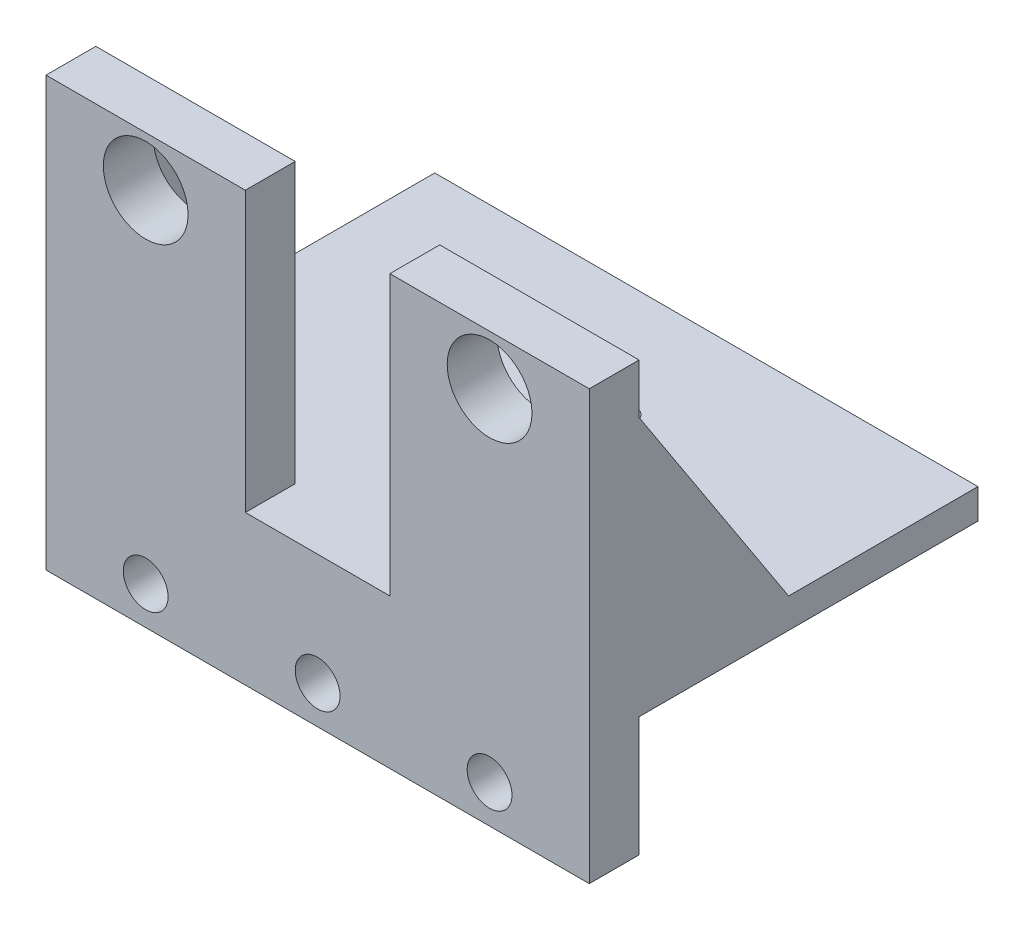
ISO-10303-21;
HEADER;
FILE_DESCRIPTION(('STEP AP214'),'2;1');
FILE_NAME('part.step','',(''),(''),'','','');
FILE_SCHEMA(('AUTOMOTIVE_DESIGN { 1 0 10303 214 1 1 1 1 }'));
ENDSEC;
DATA;
#1=APPLICATION_CONTEXT('core data for automotive mechanical design processes');
#2=APPLICATION_PROTOCOL_DEFINITION('international standard','automotive_design',2000,#1);
#3=PRODUCT_CONTEXT('',#1,'mechanical');
#4=PRODUCT('Part','Part','',(#3));
#5=PRODUCT_RELATED_PRODUCT_CATEGORY('part','',(#4));
#6=PRODUCT_DEFINITION_FORMATION('','',#4);
#7=PRODUCT_DEFINITION_CONTEXT('part definition',#1,'design');
#8=PRODUCT_DEFINITION('design','',#6,#7);
#9=PRODUCT_DEFINITION_SHAPE('','',#8);
#10=(LENGTH_UNIT() NAMED_UNIT(*) SI_UNIT(.MILLI.,.METRE.));
#11=(NAMED_UNIT(*) PLANE_ANGLE_UNIT() SI_UNIT($,.RADIAN.));
#12=(NAMED_UNIT(*) SI_UNIT($,.STERADIAN.) SOLID_ANGLE_UNIT());
#13=UNCERTAINTY_MEASURE_WITH_UNIT(LENGTH_MEASURE(1.E-05),#10,'distance_accuracy_value','');
#14=(GEOMETRIC_REPRESENTATION_CONTEXT(3) GLOBAL_UNCERTAINTY_ASSIGNED_CONTEXT((#13)) GLOBAL_UNIT_ASSIGNED_CONTEXT((#10,
#11,#12)) REPRESENTATION_CONTEXT('',''));
#15=CARTESIAN_POINT('',(0.,0.,0.));
#16=DIRECTION('',(0.,0.,1.));
#17=DIRECTION('',(1.,0.,0.));
#18=AXIS2_PLACEMENT_3D('',#15,#16,#17);
#19=CARTESIAN_POINT('',(0.,3.,0.));
#20=DIRECTION('',(0.,-1.,0.));
#21=DIRECTION('',(0.,0.,-1.));
#22=AXIS2_PLACEMENT_3D('',#19,#20,#21);
#23=PLANE('',#22);
#24=CARTESIAN_POINT('',(-10.1495438408786,3.,-0.129312584143204));
#25=DIRECTION('',(0.,1.,0.));
#26=DIRECTION('',(0.,0.,1.));
#27=AXIS2_PLACEMENT_3D('',#24,#25,#26);
#28=CIRCLE('',#27,1.19999999999999);
#29=CARTESIAN_POINT('',(-10.7694178200066,3.,-1.1568125841432));
#30=VERTEX_POINT('',#29);
#31=CARTESIAN_POINT('',(-9.52966986175057,3.,-1.1568125841432));
#32=VERTEX_POINT('',#31);
#33=EDGE_CURVE('E318',#30,#32,#28,.T.);
#34=ORIENTED_EDGE('',*,*,#33,.F.);
#35=CARTESIAN_POINT('',(-10.1495438408786,3.,-8.1293125841432));
#36=DIRECTION('',(0.,1.,0.));
#37=DIRECTION('',(0.,0.,1.));
#38=AXIS2_PLACEMENT_3D('',#35,#36,#37);
#39=CIRCLE('',#38,7.);
#40=CARTESIAN_POINT('',(-17.121371404645,3.,-7.50192082367236));
#41=VERTEX_POINT('',#40);
#42=EDGE_CURVE('E339',#41,#30,#39,.T.);
#43=ORIENTED_EDGE('',*,*,#42,.F.);
#44=CARTESIAN_POINT('',(-18.1442983711941,3.,-8.12931258414321));
#45=DIRECTION('',(0.,1.,0.));
#46=DIRECTION('',(0.,0.,1.));
#47=AXIS2_PLACEMENT_3D('',#44,#45,#46);
#48=CIRCLE('',#47,1.19999999999999);
#49=CARTESIAN_POINT('',(-17.121371404645,3.,-8.75670434461406));
#50=VERTEX_POINT('',#49);
#51=EDGE_CURVE('E326',#50,#41,#48,.T.);
#52=ORIENTED_EDGE('',*,*,#51,.F.);
#53=CARTESIAN_POINT('',(-10.7694178200066,3.,-15.1018125841432));
#54=VERTEX_POINT('',#53);
#55=EDGE_CURVE('E335',#54,#50,#39,.T.);
#56=ORIENTED_EDGE('',*,*,#55,.F.);
#57=CARTESIAN_POINT('',(-10.1495438408786,3.,-16.1293125841432));
#58=DIRECTION('',(0.,1.,0.));
#59=DIRECTION('',(0.,0.,1.));
#60=AXIS2_PLACEMENT_3D('',#57,#58,#59);
#61=CIRCLE('',#60,1.19999999999999);
#62=CARTESIAN_POINT('',(-9.52966986175058,3.,-15.1018125841432));
#63=VERTEX_POINT('',#62);
#64=EDGE_CURVE('E330',#63,#54,#61,.T.);
#65=ORIENTED_EDGE('',*,*,#64,.F.);
#66=CARTESIAN_POINT('',(-3.17771627711215,3.,-8.75670434461405));
#67=VERTEX_POINT('',#66);
#68=EDGE_CURVE('E334',#67,#63,#39,.T.);
#69=ORIENTED_EDGE('',*,*,#68,.F.);
#70=CARTESIAN_POINT('',(-2.15478931056309,3.,-8.12931258414321));
#71=DIRECTION('',(0.,1.,0.));
#72=DIRECTION('',(0.,0.,1.));
#73=AXIS2_PLACEMENT_3D('',#70,#71,#72);
#74=CIRCLE('',#73,1.19999999999999);
#75=CARTESIAN_POINT('',(-3.17771627711215,3.,-7.50192082367236));
#76=VERTEX_POINT('',#75);
#77=EDGE_CURVE('E322',#76,#67,#74,.T.);
#78=ORIENTED_EDGE('',*,*,#77,.F.);
#79=EDGE_CURVE('E340',#32,#76,#39,.T.);
#80=ORIENTED_EDGE('',*,*,#79,.F.);
#81=EDGE_LOOP('',(#34,#43,#52,#56,#65,#69,#78,#80));
#82=FACE_BOUND('',#81,.T.);
#83=DIRECTION('',(0.,0.,1.));
#84=VECTOR('',#83,1.);
#85=CARTESIAN_POINT('',(-40.6495438408786,3.,11.3706874158568));
#86=LINE('',#85,#84);
#87=CARTESIAN_POINT('',(-40.6495438408786,3.,-27.6293125841432));
#88=VERTEX_POINT('',#87);
#89=CARTESIAN_POINT('',(-40.6495438408786,3.,-8.6293125841432));
#90=VERTEX_POINT('',#89);
#91=EDGE_CURVE('E53',#88,#90,#86,.T.);
#92=ORIENTED_EDGE('',*,*,#91,.T.);
#93=DIRECTION('',(1.,0.,0.));
#94=VECTOR('',#93,1.);
#95=CARTESIAN_POINT('',(0.,3.,-8.6293125841432));
#96=LINE('',#95,#94);
#97=CARTESIAN_POINT('',(-35.6495438408786,3.,-8.6293125841432));
#98=VERTEX_POINT('',#97);
#99=EDGE_CURVE('E48',#90,#98,#96,.T.);
#100=ORIENTED_EDGE('',*,*,#99,.T.);
#101=DIRECTION('',(0.,0.,-1.));
#102=VECTOR('',#101,1.);
#103=CARTESIAN_POINT('',(-35.6495438408786,3.,0.));
#104=LINE('',#103,#102);
#105=CARTESIAN_POINT('',(-35.6495438408786,3.,6.3706874158568));
#106=VERTEX_POINT('',#105);
#107=EDGE_CURVE('E205',#106,#98,#104,.T.);
#108=ORIENTED_EDGE('',*,*,#107,.F.);
#109=DIRECTION('',(-1.,0.,0.));
#110=VECTOR('',#109,1.);
#111=CARTESIAN_POINT('',(-40.6495438408786,3.,6.3706874158568));
#112=LINE('',#111,#110);
#113=CARTESIAN_POINT('',(-20.6495438408786,3.,6.3706874158568));
#114=VERTEX_POINT('',#113);
#115=EDGE_CURVE('E192',#114,#106,#112,.T.);
#116=ORIENTED_EDGE('',*,*,#115,.F.);
#117=DIRECTION('',(0.,0.,-1.));
#118=VECTOR('',#117,1.);
#119=CARTESIAN_POINT('',(-20.6495438408786,3.,11.3706874158568));
#120=LINE('',#119,#118);
#121=CARTESIAN_POINT('',(-20.6495438408786,3.,11.3706874158568));
#122=VERTEX_POINT('',#121);
#123=EDGE_CURVE('E203',#122,#114,#120,.T.);
#124=ORIENTED_EDGE('',*,*,#123,.F.);
#125=DIRECTION('',(1.,0.,0.));
#126=VECTOR('',#125,1.);
#127=CARTESIAN_POINT('',(-40.6495438408786,3.,11.3706874158568));
#128=LINE('',#127,#126);
#129=CARTESIAN_POINT('',(-6.14954384087858,3.,11.3706874158568));
#130=VERTEX_POINT('',#129);
#131=EDGE_CURVE('E342',#122,#130,#128,.T.);
#132=ORIENTED_EDGE('',*,*,#131,.T.);
#133=DIRECTION('',(0.,0.,1.));
#134=VECTOR('',#133,1.);
#135=CARTESIAN_POINT('',(-6.14954384087857,3.,11.3706874158568));
#136=LINE('',#135,#134);
#137=CARTESIAN_POINT('',(-6.14954384087857,3.,6.3706874158568));
#138=VERTEX_POINT('',#137);
#139=EDGE_CURVE('E301',#138,#130,#136,.T.);
#140=ORIENTED_EDGE('',*,*,#139,.F.);
#141=DIRECTION('',(-1.,0.,0.));
#142=VECTOR('',#141,1.);
#143=CARTESIAN_POINT('',(13.8504561591214,3.,6.3706874158568));
#144=LINE('',#143,#142);
#145=CARTESIAN_POINT('',(8.85045615912142,3.,6.3706874158568));
#146=VERTEX_POINT('',#145);
#147=EDGE_CURVE('E297',#146,#138,#144,.T.);
#148=ORIENTED_EDGE('',*,*,#147,.F.);
#149=DIRECTION('',(0.,0.,1.));
#150=VECTOR('',#149,1.);
#151=CARTESIAN_POINT('',(8.85045615912142,3.,0.));
#152=LINE('',#151,#150);
#153=CARTESIAN_POINT('',(8.85045615912142,3.,-8.6293125841432));
#154=VERTEX_POINT('',#153);
#155=EDGE_CURVE('E230',#154,#146,#152,.T.);
#156=ORIENTED_EDGE('',*,*,#155,.F.);
#157=DIRECTION('',(-1.,0.,0.));
#158=VECTOR('',#157,1.);
#159=CARTESIAN_POINT('',(0.,3.,-8.6293125841432));
#160=LINE('',#159,#158);
#161=CARTESIAN_POINT('',(13.8504561591214,3.,-8.6293125841432));
#162=VERTEX_POINT('',#161);
#163=EDGE_CURVE('E235',#154,#162,#160,.F.);
#164=ORIENTED_EDGE('',*,*,#163,.T.);
#165=DIRECTION('',(0.,0.,-1.));
#166=VECTOR('',#165,1.);
#167=CARTESIAN_POINT('',(13.8504561591214,3.,11.3706874158568));
#168=LINE('',#167,#166);
#169=CARTESIAN_POINT('',(13.8504561591214,3.,-27.6293125841432));
#170=VERTEX_POINT('',#169);
#171=EDGE_CURVE('E345',#162,#170,#168,.T.);
#172=ORIENTED_EDGE('',*,*,#171,.T.);
#173=DIRECTION('',(-1.,0.,0.));
#174=VECTOR('',#173,1.);
#175=CARTESIAN_POINT('',(-40.6495438408786,3.,-27.6293125841432));
#176=LINE('',#175,#174);
#177=EDGE_CURVE('E347',#170,#88,#176,.T.);
#178=ORIENTED_EDGE('',*,*,#177,.T.);
#179=EDGE_LOOP('',(#92,#100,#108,#116,#124,#132,#140,#148,#156,#164,#172,#178));
#180=FACE_BOUND('',#179,.T.);
#181=ADVANCED_FACE('F32',(#82,#180),#23,.F.);
#182=CARTESIAN_POINT('',(-10.1495438408786,-2.,-8.1293125841432));
#183=DIRECTION('',(0.,1.,0.));
#184=DIRECTION('',(0.,0.,1.));
#185=AXIS2_PLACEMENT_3D('',#182,#183,#184);
#186=CYLINDRICAL_SURFACE('',#185,7.);
#187=CARTESIAN_POINT('',(-10.1495438408786,0.,-8.1293125841432));
#188=DIRECTION('',(0.,-1.,0.));
#189=DIRECTION('',(0.,0.,-1.));
#190=AXIS2_PLACEMENT_3D('',#187,#188,#189);
#191=CIRCLE('',#190,7.);
#192=CARTESIAN_POINT('',(-3.17771627711215,0.,-7.50192082367236));
#193=VERTEX_POINT('',#192);
#194=CARTESIAN_POINT('',(-9.52966986175059,0.,-1.1568125841432));
#195=VERTEX_POINT('',#194);
#196=EDGE_CURVE('E369',#193,#195,#191,.T.);
#197=ORIENTED_EDGE('',*,*,#196,.T.);
#198=DIRECTION('',(0.,1.,0.));
#199=VECTOR('',#198,1.);
#200=CARTESIAN_POINT('',(-9.52966986175059,-5.5,-1.15681258414321));
#201=LINE('',#200,#199);
#202=EDGE_CURVE('E11',#195,#32,#201,.T.);
#203=ORIENTED_EDGE('',*,*,#202,.T.);
#204=ORIENTED_EDGE('',*,*,#79,.T.);
#205=DIRECTION('',(0.,1.,0.));
#206=VECTOR('',#205,1.);
#207=CARTESIAN_POINT('',(-3.17771627711215,-5.5,-7.50192082367236));
#208=LINE('',#207,#206);
#209=EDGE_CURVE('E382',#76,#193,#208,.F.);
#210=ORIENTED_EDGE('',*,*,#209,.T.);
#211=EDGE_LOOP('',(#197,#203,#204,#210));
#212=FACE_BOUND('',#211,.T.);
#213=ADVANCED_FACE('F435',(#212),#186,.F.);
#214=CARTESIAN_POINT('',(-9.52966986175059,0.,-15.1018125841432));
#215=VERTEX_POINT('',#214);
#216=CARTESIAN_POINT('',(-3.17771627711215,0.,-8.75670434461405));
#217=VERTEX_POINT('',#216);
#218=EDGE_CURVE('E353',#215,#217,#191,.T.);
#219=ORIENTED_EDGE('',*,*,#218,.T.);
#220=DIRECTION('',(0.,1.,0.));
#221=VECTOR('',#220,1.);
#222=CARTESIAN_POINT('',(-3.17771627711215,-5.5,-8.75670434461405));
#223=LINE('',#222,#221);
#224=EDGE_CURVE('E385',#217,#67,#223,.T.);
#225=ORIENTED_EDGE('',*,*,#224,.T.);
#226=ORIENTED_EDGE('',*,*,#68,.T.);
#227=DIRECTION('',(0.,1.,0.));
#228=VECTOR('',#227,1.);
#229=CARTESIAN_POINT('',(-9.52966986175059,-5.5,-15.1018125841432));
#230=LINE('',#229,#228);
#231=EDGE_CURVE('E366',#63,#215,#230,.F.);
#232=ORIENTED_EDGE('',*,*,#231,.T.);
#233=EDGE_LOOP('',(#219,#225,#226,#232));
#234=FACE_BOUND('',#233,.T.);
#235=ADVANCED_FACE('F416',(#234),#186,.F.);
#236=ORIENTED_EDGE('',*,*,#42,.T.);
#237=DIRECTION('',(0.,1.,0.));
#238=VECTOR('',#237,1.);
#239=CARTESIAN_POINT('',(-10.7694178200066,-5.5,-1.15681258414321));
#240=LINE('',#239,#238);
#241=CARTESIAN_POINT('',(-10.7694178200066,0.,-1.1568125841432));
#242=VERTEX_POINT('',#241);
#243=EDGE_CURVE('E41',#30,#242,#240,.F.);
#244=ORIENTED_EDGE('',*,*,#243,.T.);
#245=CARTESIAN_POINT('',(-17.121371404645,0.,-7.50192082367236));
#246=VERTEX_POINT('',#245);
#247=EDGE_CURVE('E370',#242,#246,#191,.T.);
#248=ORIENTED_EDGE('',*,*,#247,.T.);
#249=DIRECTION('',(0.,1.,0.));
#250=VECTOR('',#249,1.);
#251=CARTESIAN_POINT('',(-17.121371404645,-5.5,-7.50192082367236));
#252=LINE('',#251,#250);
#253=EDGE_CURVE('E379',#246,#41,#252,.T.);
#254=ORIENTED_EDGE('',*,*,#253,.T.);
#255=EDGE_LOOP('',(#236,#244,#248,#254));
#256=FACE_BOUND('',#255,.T.);
#257=ADVANCED_FACE('F392',(#256),#186,.F.);
#258=CARTESIAN_POINT('',(-40.6495438408786,3.,11.3706874158568));
#259=DIRECTION('',(1.,0.,0.));
#260=DIRECTION('',(0.,0.,-1.));
#261=AXIS2_PLACEMENT_3D('',#258,#259,#260);
#262=PLANE('',#261);
#263=DIRECTION('',(0.,-1.,0.));
#264=VECTOR('',#263,1.);
#265=CARTESIAN_POINT('',(-40.6495438408786,3.,11.3706874158568));
#266=LINE('',#265,#264);
#267=CARTESIAN_POINT('',(-40.6495438408786,31.,11.3706874158568));
#268=VERTEX_POINT('',#267);
#269=CARTESIAN_POINT('',(-40.6495438408786,-12.,11.3706874158568));
#270=VERTEX_POINT('',#269);
#271=EDGE_CURVE('E363',#268,#270,#266,.T.);
#272=ORIENTED_EDGE('',*,*,#271,.F.);
#273=DIRECTION('',(0.,0.,1.));
#274=VECTOR('',#273,1.);
#275=CARTESIAN_POINT('',(-40.6495438408786,31.,11.3706874158568));
#276=LINE('',#275,#274);
#277=CARTESIAN_POINT('',(-40.6495438408786,31.,6.3706874158568));
#278=VERTEX_POINT('',#277);
#279=EDGE_CURVE('E202',#278,#268,#276,.T.);
#280=ORIENTED_EDGE('',*,*,#279,.F.);
#281=DIRECTION('',(0.,-1.,0.));
#282=VECTOR('',#281,1.);
#283=CARTESIAN_POINT('',(-40.6495438408786,31.,6.3706874158568));
#284=LINE('',#283,#282);
#285=CARTESIAN_POINT('',(-40.6495438408786,26.,6.3706874158568));
#286=VERTEX_POINT('',#285);
#287=EDGE_CURVE('E289',#278,#286,#284,.T.);
#288=ORIENTED_EDGE('',*,*,#287,.T.);
#289=DIRECTION('',(0.,-0.837610596838614,-0.546267780546922));
#290=VECTOR('',#289,1.);
#291=CARTESIAN_POINT('',(-40.6495438408786,26.,6.3706874158568));
#292=LINE('',#291,#290);
#293=EDGE_CURVE('E213',#286,#90,#292,.T.);
#294=ORIENTED_EDGE('',*,*,#293,.T.);
#295=ORIENTED_EDGE('',*,*,#91,.F.);
#296=DIRECTION('',(0.,-1.,0.));
#297=VECTOR('',#296,1.);
#298=CARTESIAN_POINT('',(-40.6495438408786,3.,-27.6293125841432));
#299=LINE('',#298,#297);
#300=CARTESIAN_POINT('',(-40.6495438408786,0.,-27.6293125841432));
#301=VERTEX_POINT('',#300);
#302=EDGE_CURVE('E349',#88,#301,#299,.T.);
#303=ORIENTED_EDGE('',*,*,#302,.T.);
#304=DIRECTION('',(0.,0.,1.));
#305=VECTOR('',#304,1.);
#306=CARTESIAN_POINT('',(-40.6495438408786,0.,11.3706874158568));
#307=LINE('',#306,#305);
#308=CARTESIAN_POINT('',(-40.6495438408786,0.,6.3706874158568));
#309=VERTEX_POINT('',#308);
#310=EDGE_CURVE('E350',#301,#309,#307,.T.);
#311=ORIENTED_EDGE('',*,*,#310,.T.);
#312=DIRECTION('',(0.,1.,0.));
#313=VECTOR('',#312,1.);
#314=CARTESIAN_POINT('',(-40.6495438408786,-12.,6.3706874158568));
#315=LINE('',#314,#313);
#316=CARTESIAN_POINT('',(-40.6495438408786,-12.,6.3706874158568));
#317=VERTEX_POINT('',#316);
#318=EDGE_CURVE('E267',#317,#309,#315,.T.);
#319=ORIENTED_EDGE('',*,*,#318,.F.);
#320=DIRECTION('',(0.,0.,-1.));
#321=VECTOR('',#320,1.);
#322=CARTESIAN_POINT('',(-40.6495438408786,-12.,11.3706874158568));
#323=LINE('',#322,#321);
#324=EDGE_CURVE('E253',#270,#317,#323,.T.);
#325=ORIENTED_EDGE('',*,*,#324,.F.);
#326=EDGE_LOOP('',(#272,#280,#288,#294,#295,#303,#311,#319,#325));
#327=FACE_BOUND('',#326,.T.);
#328=ADVANCED_FACE('F34',(#327),#262,.F.);
#329=CARTESIAN_POINT('',(-40.6495438408786,3.,11.3706874158568));
#330=DIRECTION('',(0.,0.,-1.));
#331=DIRECTION('',(-1.,0.,0.));
#332=AXIS2_PLACEMENT_3D('',#329,#330,#331);
#333=PLANE('',#332);
#334=ORIENTED_EDGE('',*,*,#271,.T.);
#335=DIRECTION('',(-1.,0.,0.));
#336=VECTOR('',#335,1.);
#337=CARTESIAN_POINT('',(-40.6495438408786,-12.,11.3706874158568));
#338=LINE('',#337,#336);
#339=CARTESIAN_POINT('',(13.8504561591214,-12.,11.3706874158568));
#340=VERTEX_POINT('',#339);
#341=EDGE_CURVE('E261',#340,#270,#338,.T.);
#342=ORIENTED_EDGE('',*,*,#341,.F.);
#343=DIRECTION('',(0.,-1.,0.));
#344=VECTOR('',#343,1.);
#345=CARTESIAN_POINT('',(13.8504561591214,3.,11.3706874158568));
#346=LINE('',#345,#344);
#347=CARTESIAN_POINT('',(13.8504561591214,31.,11.3706874158568));
#348=VERTEX_POINT('',#347);
#349=EDGE_CURVE('E361',#348,#340,#346,.T.);
#350=ORIENTED_EDGE('',*,*,#349,.F.);
#351=DIRECTION('',(1.,0.,0.));
#352=VECTOR('',#351,1.);
#353=CARTESIAN_POINT('',(13.8504561591214,31.,11.3706874158568));
#354=LINE('',#353,#352);
#355=CARTESIAN_POINT('',(-6.14954384087857,31.,11.3706874158568));
#356=VERTEX_POINT('',#355);
#357=EDGE_CURVE('E305',#356,#348,#354,.T.);
#358=ORIENTED_EDGE('',*,*,#357,.F.);
#359=DIRECTION('',(0.,-1.,0.));
#360=VECTOR('',#359,1.);
#361=CARTESIAN_POINT('',(-6.14954384087857,31.,11.3706874158568));
#362=LINE('',#361,#360);
#363=EDGE_CURVE('E307',#356,#130,#362,.T.);
#364=ORIENTED_EDGE('',*,*,#363,.T.);
#365=ORIENTED_EDGE('',*,*,#131,.F.);
#366=DIRECTION('',(0.,-1.,0.));
#367=VECTOR('',#366,1.);
#368=CARTESIAN_POINT('',(-20.6495438408786,31.,11.3706874158568));
#369=LINE('',#368,#367);
#370=CARTESIAN_POINT('',(-20.6495438408786,31.,11.3706874158568));
#371=VERTEX_POINT('',#370);
#372=EDGE_CURVE('E294',#371,#122,#369,.T.);
#373=ORIENTED_EDGE('',*,*,#372,.F.);
#374=DIRECTION('',(1.,0.,0.));
#375=VECTOR('',#374,1.);
#376=CARTESIAN_POINT('',(-40.6495438408786,31.,11.3706874158568));
#377=LINE('',#376,#375);
#378=EDGE_CURVE('E283',#268,#371,#377,.T.);
#379=ORIENTED_EDGE('',*,*,#378,.F.);
#380=EDGE_LOOP('',(#334,#342,#350,#358,#364,#365,#373,#379));
#381=FACE_BOUND('',#380,.T.);
#382=CARTESIAN_POINT('',(-30.6495438408786,-8.2,11.3706874158568));
#383=DIRECTION('',(0.,0.,1.));
#384=DIRECTION('',(1.,0.,0.));
#385=AXIS2_PLACEMENT_3D('',#382,#383,#384);
#386=CIRCLE('',#385,2.24789999999999);
#387=CARTESIAN_POINT('',(-28.4016438408786,-8.2,11.3706874158568));
#388=VERTEX_POINT('',#387);
#389=EDGE_CURVE('E237',#388,#388,#386,.T.);
#390=ORIENTED_EDGE('',*,*,#389,.F.);
#391=EDGE_LOOP('',(#390));
#392=FACE_BOUND('',#391,.T.);
#393=CARTESIAN_POINT('',(-13.3995438408786,-8.2,11.3706874158568));
#394=DIRECTION('',(0.,0.,1.));
#395=DIRECTION('',(1.,0.,0.));
#396=AXIS2_PLACEMENT_3D('',#393,#394,#395);
#397=CIRCLE('',#396,2.24789999999999);
#398=CARTESIAN_POINT('',(-11.1516438408786,-8.2,11.3706874158568));
#399=VERTEX_POINT('',#398);
#400=EDGE_CURVE('E240',#399,#399,#397,.T.);
#401=ORIENTED_EDGE('',*,*,#400,.F.);
#402=EDGE_LOOP('',(#401));
#403=FACE_BOUND('',#402,.T.);
#404=CARTESIAN_POINT('',(3.85045615912143,-8.2,11.3706874158568));
#405=DIRECTION('',(0.,0.,1.));
#406=DIRECTION('',(1.,0.,0.));
#407=AXIS2_PLACEMENT_3D('',#404,#405,#406);
#408=CIRCLE('',#407,2.24789999999999);
#409=CARTESIAN_POINT('',(6.09835615912141,-8.2,11.3706874158568));
#410=VERTEX_POINT('',#409);
#411=EDGE_CURVE('E246',#410,#410,#408,.T.);
#412=ORIENTED_EDGE('',*,*,#411,.F.);
#413=EDGE_LOOP('',(#412));
#414=FACE_BOUND('',#413,.T.);
#415=CARTESIAN_POINT('',(3.85045615912143,26.,11.3706874158568));
#416=DIRECTION('',(0.,0.,-1.));
#417=DIRECTION('',(-1.,0.,0.));
#418=AXIS2_PLACEMENT_3D('',#415,#416,#417);
#419=CIRCLE('',#418,4.25);
#420=CARTESIAN_POINT('',(-0.399543840878573,26.,11.3706874158568));
#421=VERTEX_POINT('',#420);
#422=EDGE_CURVE('E271',#421,#421,#419,.T.);
#423=ORIENTED_EDGE('',*,*,#422,.T.);
#424=EDGE_LOOP('',(#423));
#425=FACE_BOUND('',#424,.T.);
#426=CARTESIAN_POINT('',(-30.6495438408786,26.,11.3706874158568));
#427=DIRECTION('',(0.,0.,-1.));
#428=DIRECTION('',(-1.,0.,0.));
#429=AXIS2_PLACEMENT_3D('',#426,#427,#428);
#430=CIRCLE('',#429,4.25);
#431=CARTESIAN_POINT('',(-34.8995438408786,26.,11.3706874158568));
#432=VERTEX_POINT('',#431);
#433=EDGE_CURVE('E277',#432,#432,#430,.T.);
#434=ORIENTED_EDGE('',*,*,#433,.T.);
#435=EDGE_LOOP('',(#434));
#436=FACE_BOUND('',#435,.T.);
#437=ADVANCED_FACE('F452',(#381,#392,#403,#414,#425,#436),#333,.F.);
#438=CARTESIAN_POINT('',(13.8504561591214,3.,11.3706874158568));
#439=DIRECTION('',(-1.,0.,0.));
#440=DIRECTION('',(0.,0.,1.));
#441=AXIS2_PLACEMENT_3D('',#438,#439,#440);
#442=PLANE('',#441);
#443=ORIENTED_EDGE('',*,*,#171,.F.);
#444=DIRECTION('',(0.,-0.837610596838614,-0.546267780546922));
#445=VECTOR('',#444,1.);
#446=CARTESIAN_POINT('',(13.8504561591214,26.,6.3706874158568));
#447=LINE('',#446,#445);
#448=CARTESIAN_POINT('',(13.8504561591214,26.,6.3706874158568));
#449=VERTEX_POINT('',#448);
#450=EDGE_CURVE('E222',#449,#162,#447,.T.);
#451=ORIENTED_EDGE('',*,*,#450,.F.);
#452=DIRECTION('',(0.,-1.,0.));
#453=VECTOR('',#452,1.);
#454=CARTESIAN_POINT('',(13.8504561591214,31.,6.3706874158568));
#455=LINE('',#454,#453);
#456=CARTESIAN_POINT('',(13.8504561591214,31.,6.3706874158568));
#457=VERTEX_POINT('',#456);
#458=EDGE_CURVE('E316',#457,#449,#455,.T.);
#459=ORIENTED_EDGE('',*,*,#458,.F.);
#460=DIRECTION('',(0.,0.,-1.));
#461=VECTOR('',#460,1.);
#462=CARTESIAN_POINT('',(13.8504561591214,31.,11.3706874158568));
#463=LINE('',#462,#461);
#464=EDGE_CURVE('E298',#348,#457,#463,.T.);
#465=ORIENTED_EDGE('',*,*,#464,.F.);
#466=ORIENTED_EDGE('',*,*,#349,.T.);
#467=DIRECTION('',(0.,0.,1.));
#468=VECTOR('',#467,1.);
#469=CARTESIAN_POINT('',(13.8504561591214,-12.,11.3706874158568));
#470=LINE('',#469,#468);
#471=CARTESIAN_POINT('',(13.8504561591214,-12.,6.3706874158568));
#472=VERTEX_POINT('',#471);
#473=EDGE_CURVE('E258',#472,#340,#470,.T.);
#474=ORIENTED_EDGE('',*,*,#473,.F.);
#475=DIRECTION('',(0.,1.,0.));
#476=VECTOR('',#475,1.);
#477=CARTESIAN_POINT('',(13.8504561591214,-12.,6.3706874158568));
#478=LINE('',#477,#476);
#479=CARTESIAN_POINT('',(13.8504561591214,0.,6.3706874158568));
#480=VERTEX_POINT('',#479);
#481=EDGE_CURVE('E263',#472,#480,#478,.T.);
#482=ORIENTED_EDGE('',*,*,#481,.T.);
#483=DIRECTION('',(0.,0.,-1.));
#484=VECTOR('',#483,1.);
#485=CARTESIAN_POINT('',(13.8504561591214,0.,11.3706874158568));
#486=LINE('',#485,#484);
#487=CARTESIAN_POINT('',(13.8504561591214,0.,-27.6293125841432));
#488=VERTEX_POINT('',#487);
#489=EDGE_CURVE('E352',#480,#488,#486,.T.);
#490=ORIENTED_EDGE('',*,*,#489,.T.);
#491=DIRECTION('',(0.,-1.,0.));
#492=VECTOR('',#491,1.);
#493=CARTESIAN_POINT('',(13.8504561591214,3.,-27.6293125841432));
#494=LINE('',#493,#492);
#495=EDGE_CURVE('E358',#170,#488,#494,.T.);
#496=ORIENTED_EDGE('',*,*,#495,.F.);
#497=EDGE_LOOP('',(#443,#451,#459,#465,#466,#474,#482,#490,#496));
#498=FACE_BOUND('',#497,.T.);
#499=ADVANCED_FACE('F449',(#498),#442,.F.);
#500=CARTESIAN_POINT('',(-40.6495438408786,3.,-27.6293125841432));
#501=DIRECTION('',(0.,0.,1.));
#502=DIRECTION('',(1.,0.,0.));
#503=AXIS2_PLACEMENT_3D('',#500,#501,#502);
#504=PLANE('',#503);
#505=DIRECTION('',(-1.,0.,0.));
#506=VECTOR('',#505,1.);
#507=CARTESIAN_POINT('',(-40.6495438408786,0.,-27.6293125841432));
#508=LINE('',#507,#506);
#509=EDGE_CURVE('E343',#488,#301,#508,.T.);
#510=ORIENTED_EDGE('',*,*,#509,.T.);
#511=ORIENTED_EDGE('',*,*,#302,.F.);
#512=ORIENTED_EDGE('',*,*,#177,.F.);
#513=ORIENTED_EDGE('',*,*,#495,.T.);
#514=EDGE_LOOP('',(#510,#511,#512,#513));
#515=FACE_BOUND('',#514,.T.);
#516=ADVANCED_FACE('F445',(#515),#504,.F.);
#517=CARTESIAN_POINT('',(0.,0.,0.));
#518=DIRECTION('',(0.,-1.,0.));
#519=DIRECTION('',(0.,0.,-1.));
#520=AXIS2_PLACEMENT_3D('',#517,#518,#519);
#521=PLANE('',#520);
#522=DIRECTION('',(1.,0.,0.));
#523=VECTOR('',#522,1.);
#524=CARTESIAN_POINT('',(-40.6495438408786,0.,6.3706874158568));
#525=LINE('',#524,#523);
#526=EDGE_CURVE('E252',#309,#480,#525,.T.);
#527=ORIENTED_EDGE('',*,*,#526,.F.);
#528=ORIENTED_EDGE('',*,*,#310,.F.);
#529=ORIENTED_EDGE('',*,*,#509,.F.);
#530=ORIENTED_EDGE('',*,*,#489,.F.);
#531=EDGE_LOOP('',(#527,#528,#529,#530));
#532=FACE_BOUND('',#531,.T.);
#533=CARTESIAN_POINT('',(-10.1495438408786,0.,-0.129312584143204));
#534=DIRECTION('',(0.,-1.,0.));
#535=DIRECTION('',(0.,0.,-1.));
#536=AXIS2_PLACEMENT_3D('',#533,#534,#535);
#537=CIRCLE('',#536,1.19999999999999);
#538=EDGE_CURVE('E320',#195,#242,#537,.T.);
#539=ORIENTED_EDGE('',*,*,#538,.F.);
#540=ORIENTED_EDGE('',*,*,#196,.F.);
#541=CARTESIAN_POINT('',(-2.15478931056309,0.,-8.12931258414321));
#542=DIRECTION('',(0.,-1.,0.));
#543=DIRECTION('',(0.,0.,-1.));
#544=AXIS2_PLACEMENT_3D('',#541,#542,#543);
#545=CIRCLE('',#544,1.19999999999999);
#546=EDGE_CURVE('E324',#217,#193,#545,.T.);
#547=ORIENTED_EDGE('',*,*,#546,.F.);
#548=ORIENTED_EDGE('',*,*,#218,.F.);
#549=CARTESIAN_POINT('',(-10.1495438408786,0.,-16.1293125841432));
#550=DIRECTION('',(0.,-1.,0.));
#551=DIRECTION('',(0.,0.,-1.));
#552=AXIS2_PLACEMENT_3D('',#549,#550,#551);
#553=CIRCLE('',#552,1.19999999999999);
#554=CARTESIAN_POINT('',(-10.7694178200066,0.,-15.1018125841432));
#555=VERTEX_POINT('',#554);
#556=EDGE_CURVE('E332',#555,#215,#553,.T.);
#557=ORIENTED_EDGE('',*,*,#556,.F.);
#558=CARTESIAN_POINT('',(-17.121371404645,0.,-8.75670434461406));
#559=VERTEX_POINT('',#558);
#560=EDGE_CURVE('E338',#559,#555,#191,.T.);
#561=ORIENTED_EDGE('',*,*,#560,.F.);
#562=CARTESIAN_POINT('',(-18.1442983711941,0.,-8.12931258414321));
#563=DIRECTION('',(0.,-1.,0.));
#564=DIRECTION('',(0.,0.,-1.));
#565=AXIS2_PLACEMENT_3D('',#562,#563,#564);
#566=CIRCLE('',#565,1.19999999999999);
#567=EDGE_CURVE('E328',#246,#559,#566,.T.);
#568=ORIENTED_EDGE('',*,*,#567,.F.);
#569=ORIENTED_EDGE('',*,*,#247,.F.);
#570=EDGE_LOOP('',(#539,#540,#547,#548,#557,#561,#568,#569));
#571=FACE_BOUND('',#570,.T.);
#572=ADVANCED_FACE('F400',(#532,#571),#521,.T.);
#573=ORIENTED_EDGE('',*,*,#55,.T.);
#574=DIRECTION('',(0.,1.,0.));
#575=VECTOR('',#574,1.);
#576=CARTESIAN_POINT('',(-17.121371404645,-5.5,-8.75670434461405));
#577=LINE('',#576,#575);
#578=EDGE_CURVE('E376',#50,#559,#577,.F.);
#579=ORIENTED_EDGE('',*,*,#578,.T.);
#580=ORIENTED_EDGE('',*,*,#560,.T.);
#581=DIRECTION('',(0.,1.,0.));
#582=VECTOR('',#581,1.);
#583=CARTESIAN_POINT('',(-10.7694178200066,-5.5,-15.1018125841432));
#584=LINE('',#583,#582);
#585=EDGE_CURVE('E373',#555,#54,#584,.T.);
#586=ORIENTED_EDGE('',*,*,#585,.T.);
#587=EDGE_LOOP('',(#573,#579,#580,#586));
#588=FACE_BOUND('',#587,.T.);
#589=ADVANCED_FACE('F406',(#588),#186,.F.);
#590=CARTESIAN_POINT('',(-10.1495438408786,3.,-16.1293125841432));
#591=DIRECTION('',(0.,1.,0.));
#592=DIRECTION('',(0.,0.,1.));
#593=AXIS2_PLACEMENT_3D('',#590,#591,#592);
#594=CYLINDRICAL_SURFACE('',#593,1.19999999999999);
#595=ORIENTED_EDGE('',*,*,#556,.T.);
#596=ORIENTED_EDGE('',*,*,#231,.F.);
#597=ORIENTED_EDGE('',*,*,#64,.T.);
#598=ORIENTED_EDGE('',*,*,#585,.F.);
#599=EDGE_LOOP('',(#595,#596,#597,#598));
#600=FACE_BOUND('',#599,.T.);
#601=ADVANCED_FACE('F410',(#600),#594,.F.);
#602=CARTESIAN_POINT('',(-18.1442983711941,3.,-8.12931258414321));
#603=DIRECTION('',(0.,1.,0.));
#604=DIRECTION('',(0.,0.,1.));
#605=AXIS2_PLACEMENT_3D('',#602,#603,#604);
#606=CYLINDRICAL_SURFACE('',#605,1.19999999999999);
#607=ORIENTED_EDGE('',*,*,#567,.T.);
#608=ORIENTED_EDGE('',*,*,#578,.F.);
#609=ORIENTED_EDGE('',*,*,#51,.T.);
#610=ORIENTED_EDGE('',*,*,#253,.F.);
#611=EDGE_LOOP('',(#607,#608,#609,#610));
#612=FACE_BOUND('',#611,.T.);
#613=ADVANCED_FACE('F422',(#612),#606,.F.);
#614=CARTESIAN_POINT('',(-2.15478931056309,3.,-8.12931258414321));
#615=DIRECTION('',(0.,1.,0.));
#616=DIRECTION('',(0.,0.,1.));
#617=AXIS2_PLACEMENT_3D('',#614,#615,#616);
#618=CYLINDRICAL_SURFACE('',#617,1.19999999999999);
#619=ORIENTED_EDGE('',*,*,#546,.T.);
#620=ORIENTED_EDGE('',*,*,#209,.F.);
#621=ORIENTED_EDGE('',*,*,#77,.T.);
#622=ORIENTED_EDGE('',*,*,#224,.F.);
#623=EDGE_LOOP('',(#619,#620,#621,#622));
#624=FACE_BOUND('',#623,.T.);
#625=ADVANCED_FACE('F424',(#624),#618,.F.);
#626=CARTESIAN_POINT('',(-10.1495438408786,3.,-0.129312584143204));
#627=DIRECTION('',(0.,1.,0.));
#628=DIRECTION('',(0.,0.,1.));
#629=AXIS2_PLACEMENT_3D('',#626,#627,#628);
#630=CYLINDRICAL_SURFACE('',#629,1.19999999999999);
#631=ORIENTED_EDGE('',*,*,#538,.T.);
#632=ORIENTED_EDGE('',*,*,#243,.F.);
#633=ORIENTED_EDGE('',*,*,#33,.T.);
#634=ORIENTED_EDGE('',*,*,#202,.F.);
#635=EDGE_LOOP('',(#631,#632,#633,#634));
#636=FACE_BOUND('',#635,.T.);
#637=ADVANCED_FACE('F430',(#636),#630,.F.);
#638=CARTESIAN_POINT('',(13.8504561591214,31.,6.3706874158568));
#639=DIRECTION('',(0.,0.,1.));
#640=DIRECTION('',(1.,0.,0.));
#641=AXIS2_PLACEMENT_3D('',#638,#639,#640);
#642=PLANE('',#641);
#643=CARTESIAN_POINT('',(3.85045615912143,26.,6.3706874158568));
#644=DIRECTION('',(0.,0.,-1.));
#645=DIRECTION('',(-1.,0.,0.));
#646=AXIS2_PLACEMENT_3D('',#643,#644,#645);
#647=CIRCLE('',#646,4.25);
#648=CARTESIAN_POINT('',(-0.399543840878575,26.,6.3706874158568));
#649=VERTEX_POINT('',#648);
#650=EDGE_CURVE('E274',#649,#649,#647,.T.);
#651=ORIENTED_EDGE('',*,*,#650,.F.);
#652=EDGE_LOOP('',(#651));
#653=FACE_BOUND('',#652,.T.);
#654=ORIENTED_EDGE('',*,*,#458,.T.);
#655=DIRECTION('',(1.,0.,0.));
#656=VECTOR('',#655,1.);
#657=CARTESIAN_POINT('',(13.8504561591214,26.,6.3706874158568));
#658=LINE('',#657,#656);
#659=CARTESIAN_POINT('',(8.85045615912142,26.,6.3706874158568));
#660=VERTEX_POINT('',#659);
#661=EDGE_CURVE('E233',#449,#660,#658,.F.);
#662=ORIENTED_EDGE('',*,*,#661,.T.);
#663=DIRECTION('',(0.,1.,0.));
#664=VECTOR('',#663,1.);
#665=CARTESIAN_POINT('',(8.85045615912142,31.,6.3706874158568));
#666=LINE('',#665,#664);
#667=EDGE_CURVE('E225',#146,#660,#666,.T.);
#668=ORIENTED_EDGE('',*,*,#667,.F.);
#669=ORIENTED_EDGE('',*,*,#147,.T.);
#670=DIRECTION('',(0.,-1.,0.));
#671=VECTOR('',#670,1.);
#672=CARTESIAN_POINT('',(-6.14954384087857,31.,6.3706874158568));
#673=LINE('',#672,#671);
#674=CARTESIAN_POINT('',(-6.14954384087857,31.,6.3706874158568));
#675=VERTEX_POINT('',#674);
#676=EDGE_CURVE('E313',#675,#138,#673,.T.);
#677=ORIENTED_EDGE('',*,*,#676,.F.);
#678=DIRECTION('',(-1.,0.,0.));
#679=VECTOR('',#678,1.);
#680=CARTESIAN_POINT('',(13.8504561591214,31.,6.3706874158568));
#681=LINE('',#680,#679);
#682=EDGE_CURVE('E300',#457,#675,#681,.T.);
#683=ORIENTED_EDGE('',*,*,#682,.F.);
#684=EDGE_LOOP('',(#654,#662,#668,#669,#677,#683));
#685=FACE_BOUND('',#684,.T.);
#686=ADVANCED_FACE('F502',(#653,#685),#642,.F.);
#687=CARTESIAN_POINT('',(-6.14954384087857,31.,11.3706874158568));
#688=DIRECTION('',(1.,0.,0.));
#689=DIRECTION('',(0.,0.,-1.));
#690=AXIS2_PLACEMENT_3D('',#687,#688,#689);
#691=PLANE('',#690);
#692=ORIENTED_EDGE('',*,*,#139,.T.);
#693=ORIENTED_EDGE('',*,*,#363,.F.);
#694=DIRECTION('',(0.,0.,1.));
#695=VECTOR('',#694,1.);
#696=CARTESIAN_POINT('',(-6.14954384087857,31.,11.3706874158568));
#697=LINE('',#696,#695);
#698=EDGE_CURVE('E303',#675,#356,#697,.T.);
#699=ORIENTED_EDGE('',*,*,#698,.F.);
#700=ORIENTED_EDGE('',*,*,#676,.T.);
#701=EDGE_LOOP('',(#692,#693,#699,#700));
#702=FACE_BOUND('',#701,.T.);
#703=ADVANCED_FACE('F498',(#702),#691,.F.);
#704=CARTESIAN_POINT('',(0.,31.,0.));
#705=DIRECTION('',(0.,1.,0.));
#706=DIRECTION('',(0.,0.,1.));
#707=AXIS2_PLACEMENT_3D('',#704,#705,#706);
#708=PLANE('',#707);
#709=ORIENTED_EDGE('',*,*,#464,.T.);
#710=ORIENTED_EDGE('',*,*,#682,.T.);
#711=ORIENTED_EDGE('',*,*,#698,.T.);
#712=ORIENTED_EDGE('',*,*,#357,.T.);
#713=EDGE_LOOP('',(#709,#710,#711,#712));
#714=FACE_BOUND('',#713,.T.);
#715=ADVANCED_FACE('F492',(#714),#708,.T.);
#716=CARTESIAN_POINT('',(-20.6495438408786,31.,11.3706874158568));
#717=DIRECTION('',(-1.,0.,0.));
#718=DIRECTION('',(0.,0.,1.));
#719=AXIS2_PLACEMENT_3D('',#716,#717,#718);
#720=PLANE('',#719);
#721=ORIENTED_EDGE('',*,*,#123,.T.);
#722=DIRECTION('',(0.,-1.,0.));
#723=VECTOR('',#722,1.);
#724=CARTESIAN_POINT('',(-20.6495438408786,31.,6.3706874158568));
#725=LINE('',#724,#723);
#726=CARTESIAN_POINT('',(-20.6495438408786,31.,6.3706874158568));
#727=VERTEX_POINT('',#726);
#728=EDGE_CURVE('E199',#727,#114,#725,.T.);
#729=ORIENTED_EDGE('',*,*,#728,.F.);
#730=DIRECTION('',(0.,0.,-1.));
#731=VECTOR('',#730,1.);
#732=CARTESIAN_POINT('',(-20.6495438408786,31.,11.3706874158568));
#733=LINE('',#732,#731);
#734=EDGE_CURVE('E285',#371,#727,#733,.T.);
#735=ORIENTED_EDGE('',*,*,#734,.F.);
#736=ORIENTED_EDGE('',*,*,#372,.T.);
#737=EDGE_LOOP('',(#721,#729,#735,#736));
#738=FACE_BOUND('',#737,.T.);
#739=ADVANCED_FACE('F484',(#738),#720,.F.);
#740=CARTESIAN_POINT('',(-40.6495438408786,31.,6.3706874158568));
#741=DIRECTION('',(0.,0.,1.));
#742=DIRECTION('',(1.,0.,0.));
#743=AXIS2_PLACEMENT_3D('',#740,#741,#742);
#744=PLANE('',#743);
#745=CARTESIAN_POINT('',(-30.6495438408786,26.,6.37068741585681));
#746=DIRECTION('',(0.,0.,-1.));
#747=DIRECTION('',(-1.,0.,0.));
#748=AXIS2_PLACEMENT_3D('',#745,#746,#747);
#749=CIRCLE('',#748,4.25);
#750=CARTESIAN_POINT('',(-34.8995438408786,26.,6.37068741585681));
#751=VERTEX_POINT('',#750);
#752=EDGE_CURVE('E270',#751,#751,#749,.T.);
#753=ORIENTED_EDGE('',*,*,#752,.F.);
#754=EDGE_LOOP('',(#753));
#755=FACE_BOUND('',#754,.T.);
#756=DIRECTION('',(0.,-1.,0.));
#757=VECTOR('',#756,1.);
#758=CARTESIAN_POINT('',(-35.6495438408786,31.,6.3706874158568));
#759=LINE('',#758,#757);
#760=CARTESIAN_POINT('',(-35.6495438408786,26.,6.3706874158568));
#761=VERTEX_POINT('',#760);
#762=EDGE_CURVE('E195',#761,#106,#759,.T.);
#763=ORIENTED_EDGE('',*,*,#762,.F.);
#764=DIRECTION('',(-1.,0.,0.));
#765=VECTOR('',#764,1.);
#766=CARTESIAN_POINT('',(-40.6495438408786,26.,6.3706874158568));
#767=LINE('',#766,#765);
#768=EDGE_CURVE('E209',#761,#286,#767,.T.);
#769=ORIENTED_EDGE('',*,*,#768,.T.);
#770=ORIENTED_EDGE('',*,*,#287,.F.);
#771=DIRECTION('',(-1.,0.,0.));
#772=VECTOR('',#771,1.);
#773=CARTESIAN_POINT('',(-40.6495438408786,31.,6.3706874158568));
#774=LINE('',#773,#772);
#775=EDGE_CURVE('E287',#727,#278,#774,.T.);
#776=ORIENTED_EDGE('',*,*,#775,.F.);
#777=ORIENTED_EDGE('',*,*,#728,.T.);
#778=ORIENTED_EDGE('',*,*,#115,.T.);
#779=EDGE_LOOP('',(#763,#769,#770,#776,#777,#778));
#780=FACE_BOUND('',#779,.T.);
#781=ADVANCED_FACE('F193',(#755,#780),#744,.F.);
#782=CARTESIAN_POINT('',(0.,31.,0.));
#783=DIRECTION('',(0.,-1.,0.));
#784=DIRECTION('',(0.,0.,-1.));
#785=AXIS2_PLACEMENT_3D('',#782,#783,#784);
#786=PLANE('',#785);
#787=ORIENTED_EDGE('',*,*,#279,.T.);
#788=ORIENTED_EDGE('',*,*,#378,.T.);
#789=ORIENTED_EDGE('',*,*,#734,.T.);
#790=ORIENTED_EDGE('',*,*,#775,.T.);
#791=EDGE_LOOP('',(#787,#788,#789,#790));
#792=FACE_BOUND('',#791,.T.);
#793=ADVANCED_FACE('F479',(#792),#786,.F.);
#794=CARTESIAN_POINT('',(-30.6495438408786,26.,11.3706874158568));
#795=DIRECTION('',(0.,0.,-1.));
#796=DIRECTION('',(-1.,0.,0.));
#797=AXIS2_PLACEMENT_3D('',#794,#795,#796);
#798=CYLINDRICAL_SURFACE('',#797,4.25);
#799=ORIENTED_EDGE('',*,*,#433,.F.);
#800=EDGE_LOOP('',(#799));
#801=FACE_BOUND('',#800,.T.);
#802=ORIENTED_EDGE('',*,*,#752,.T.);
#803=EDGE_LOOP('',(#802));
#804=FACE_BOUND('',#803,.T.);
#805=ADVANCED_FACE('F475',(#801,#804),#798,.F.);
#806=CARTESIAN_POINT('',(3.85045615912143,26.,11.3706874158568));
#807=DIRECTION('',(0.,0.,-1.));
#808=DIRECTION('',(-1.,0.,0.));
#809=AXIS2_PLACEMENT_3D('',#806,#807,#808);
#810=CYLINDRICAL_SURFACE('',#809,4.25);
#811=ORIENTED_EDGE('',*,*,#422,.F.);
#812=EDGE_LOOP('',(#811));
#813=FACE_BOUND('',#812,.T.);
#814=ORIENTED_EDGE('',*,*,#650,.T.);
#815=EDGE_LOOP('',(#814));
#816=FACE_BOUND('',#815,.T.);
#817=ADVANCED_FACE('F478',(#813,#816),#810,.F.);
#818=CARTESIAN_POINT('',(-40.6495438408786,-12.,6.3706874158568));
#819=DIRECTION('',(0.,0.,1.));
#820=DIRECTION('',(1.,0.,0.));
#821=AXIS2_PLACEMENT_3D('',#818,#819,#820);
#822=PLANE('',#821);
#823=ORIENTED_EDGE('',*,*,#526,.T.);
#824=ORIENTED_EDGE('',*,*,#481,.F.);
#825=DIRECTION('',(1.,0.,0.));
#826=VECTOR('',#825,1.);
#827=CARTESIAN_POINT('',(-40.6495438408786,-12.,6.3706874158568));
#828=LINE('',#827,#826);
#829=EDGE_CURVE('E256',#317,#472,#828,.T.);
#830=ORIENTED_EDGE('',*,*,#829,.F.);
#831=ORIENTED_EDGE('',*,*,#318,.T.);
#832=EDGE_LOOP('',(#823,#824,#830,#831));
#833=FACE_BOUND('',#832,.T.);
#834=CARTESIAN_POINT('',(-30.6495438408786,-8.2,6.3706874158568));
#835=DIRECTION('',(0.,0.,1.));
#836=DIRECTION('',(1.,0.,0.));
#837=AXIS2_PLACEMENT_3D('',#834,#835,#836);
#838=CIRCLE('',#837,2.24789999999999);
#839=CARTESIAN_POINT('',(-28.4016438408786,-8.2,6.3706874158568));
#840=VERTEX_POINT('',#839);
#841=EDGE_CURVE('E36',#840,#840,#838,.T.);
#842=ORIENTED_EDGE('',*,*,#841,.T.);
#843=EDGE_LOOP('',(#842));
#844=FACE_BOUND('',#843,.T.);
#845=CARTESIAN_POINT('',(-13.3995438408786,-8.2,6.3706874158568));
#846=DIRECTION('',(0.,0.,1.));
#847=DIRECTION('',(1.,0.,0.));
#848=AXIS2_PLACEMENT_3D('',#845,#846,#847);
#849=CIRCLE('',#848,2.24789999999999);
#850=CARTESIAN_POINT('',(-11.1516438408786,-8.2,6.3706874158568));
#851=VERTEX_POINT('',#850);
#852=EDGE_CURVE('E243',#851,#851,#849,.T.);
#853=ORIENTED_EDGE('',*,*,#852,.T.);
#854=EDGE_LOOP('',(#853));
#855=FACE_BOUND('',#854,.T.);
#856=CARTESIAN_POINT('',(3.85045615912143,-8.2,6.3706874158568));
#857=DIRECTION('',(0.,0.,1.));
#858=DIRECTION('',(1.,0.,0.));
#859=AXIS2_PLACEMENT_3D('',#856,#857,#858);
#860=CIRCLE('',#859,2.24789999999999);
#861=CARTESIAN_POINT('',(6.09835615912141,-8.2,6.3706874158568));
#862=VERTEX_POINT('',#861);
#863=EDGE_CURVE('E249',#862,#862,#860,.T.);
#864=ORIENTED_EDGE('',*,*,#863,.T.);
#865=EDGE_LOOP('',(#864));
#866=FACE_BOUND('',#865,.T.);
#867=ADVANCED_FACE('F549',(#833,#844,#855,#866),#822,.F.);
#868=CARTESIAN_POINT('',(0.,-12.,0.));
#869=DIRECTION('',(0.,-1.,0.));
#870=DIRECTION('',(0.,0.,-1.));
#871=AXIS2_PLACEMENT_3D('',#868,#869,#870);
#872=PLANE('',#871);
#873=ORIENTED_EDGE('',*,*,#829,.T.);
#874=ORIENTED_EDGE('',*,*,#473,.T.);
#875=ORIENTED_EDGE('',*,*,#341,.T.);
#876=ORIENTED_EDGE('',*,*,#324,.T.);
#877=EDGE_LOOP('',(#873,#874,#875,#876));
#878=FACE_BOUND('',#877,.T.);
#879=ADVANCED_FACE('F563',(#878),#872,.T.);
#880=CARTESIAN_POINT('',(3.85045615912143,-8.2,11.3706874158568));
#881=DIRECTION('',(0.,0.,1.));
#882=DIRECTION('',(1.,0.,0.));
#883=AXIS2_PLACEMENT_3D('',#880,#881,#882);
#884=CYLINDRICAL_SURFACE('',#883,2.24789999999999);
#885=ORIENTED_EDGE('',*,*,#411,.T.);
#886=EDGE_LOOP('',(#885));
#887=FACE_BOUND('',#886,.T.);
#888=ORIENTED_EDGE('',*,*,#863,.F.);
#889=EDGE_LOOP('',(#888));
#890=FACE_BOUND('',#889,.T.);
#891=ADVANCED_FACE('F557',(#887,#890),#884,.F.);
#892=CARTESIAN_POINT('',(-13.3995438408786,-8.2,11.3706874158568));
#893=DIRECTION('',(0.,0.,1.));
#894=DIRECTION('',(1.,0.,0.));
#895=AXIS2_PLACEMENT_3D('',#892,#893,#894);
#896=CYLINDRICAL_SURFACE('',#895,2.24789999999999);
#897=ORIENTED_EDGE('',*,*,#400,.T.);
#898=EDGE_LOOP('',(#897));
#899=FACE_BOUND('',#898,.T.);
#900=ORIENTED_EDGE('',*,*,#852,.F.);
#901=EDGE_LOOP('',(#900));
#902=FACE_BOUND('',#901,.T.);
#903=ADVANCED_FACE('F562',(#899,#902),#896,.F.);
#904=CARTESIAN_POINT('',(-30.6495438408786,-8.2,11.3706874158568));
#905=DIRECTION('',(0.,0.,1.));
#906=DIRECTION('',(1.,0.,0.));
#907=AXIS2_PLACEMENT_3D('',#904,#905,#906);
#908=CYLINDRICAL_SURFACE('',#907,2.24789999999999);
#909=ORIENTED_EDGE('',*,*,#389,.T.);
#910=EDGE_LOOP('',(#909));
#911=FACE_BOUND('',#910,.T.);
#912=ORIENTED_EDGE('',*,*,#841,.F.);
#913=EDGE_LOOP('',(#912));
#914=FACE_BOUND('',#913,.T.);
#915=ADVANCED_FACE('F575',(#911,#914),#908,.F.);
#916=CARTESIAN_POINT('',(13.8504561591214,26.,6.3706874158568));
#917=DIRECTION('',(0.,-0.546267780546922,0.837610596838614));
#918=DIRECTION('',(0.,-0.837610596838614,-0.546267780546922));
#919=AXIS2_PLACEMENT_3D('',#916,#917,#918);
#920=PLANE('',#919);
#921=ORIENTED_EDGE('',*,*,#163,.F.);
#922=DIRECTION('',(0.,-0.837610596838614,-0.546267780546922));
#923=VECTOR('',#922,1.);
#924=CARTESIAN_POINT('',(8.85045615912143,26.,6.3706874158568));
#925=LINE('',#924,#923);
#926=EDGE_CURVE('E221',#660,#154,#925,.T.);
#927=ORIENTED_EDGE('',*,*,#926,.F.);
#928=ORIENTED_EDGE('',*,*,#661,.F.);
#929=ORIENTED_EDGE('',*,*,#450,.T.);
#930=EDGE_LOOP('',(#921,#927,#928,#929));
#931=FACE_BOUND('',#930,.T.);
#932=ADVANCED_FACE('F584',(#931),#920,.F.);
#933=CARTESIAN_POINT('',(8.85045615912142,9.5,-8.1293125841432));
#934=DIRECTION('',(1.,0.,0.));
#935=DIRECTION('',(0.,0.,-1.));
#936=AXIS2_PLACEMENT_3D('',#933,#934,#935);
#937=PLANE('',#936);
#938=ORIENTED_EDGE('',*,*,#926,.T.);
#939=ORIENTED_EDGE('',*,*,#155,.T.);
#940=ORIENTED_EDGE('',*,*,#667,.T.);
#941=EDGE_LOOP('',(#938,#939,#940));
#942=FACE_BOUND('',#941,.T.);
#943=ADVANCED_FACE('F692',(#942),#937,.F.);
#944=CARTESIAN_POINT('',(-40.6495438408786,26.,6.3706874158568));
#945=DIRECTION('',(0.,0.546267780546922,-0.837610596838614));
#946=DIRECTION('',(0.,-0.837610596838614,-0.546267780546922));
#947=AXIS2_PLACEMENT_3D('',#944,#945,#946);
#948=PLANE('',#947);
#949=ORIENTED_EDGE('',*,*,#99,.F.);
#950=ORIENTED_EDGE('',*,*,#293,.F.);
#951=ORIENTED_EDGE('',*,*,#768,.F.);
#952=DIRECTION('',(0.,-0.837610596838614,-0.546267780546922));
#953=VECTOR('',#952,1.);
#954=CARTESIAN_POINT('',(-35.6495438408786,26.,6.3706874158568));
#955=LINE('',#954,#953);
#956=EDGE_CURVE('E212',#761,#98,#955,.T.);
#957=ORIENTED_EDGE('',*,*,#956,.T.);
#958=EDGE_LOOP('',(#949,#950,#951,#957));
#959=FACE_BOUND('',#958,.T.);
#960=ADVANCED_FACE('F687',(#959),#948,.T.);
#961=CARTESIAN_POINT('',(-35.6495438408786,9.5,-8.1293125841432));
#962=DIRECTION('',(-1.,0.,0.));
#963=DIRECTION('',(0.,0.,1.));
#964=AXIS2_PLACEMENT_3D('',#961,#962,#963);
#965=PLANE('',#964);
#966=ORIENTED_EDGE('',*,*,#762,.T.);
#967=ORIENTED_EDGE('',*,*,#107,.T.);
#968=ORIENTED_EDGE('',*,*,#956,.F.);
#969=EDGE_LOOP('',(#966,#967,#968));
#970=FACE_BOUND('',#969,.T.);
#971=ADVANCED_FACE('F211',(#970),#965,.F.);
#972=CLOSED_SHELL('',(#181,#213,#235,#257,#328,#437,#499,#516,#572,#589,#601,#613,#625,#637,
#686,#703,#715,#739,#781,#793,#805,#817,#867,#879,#891,#903,#915,#932,#943,#960,#971));
#973=MANIFOLD_SOLID_BREP('B2',#972);
#974=ADVANCED_BREP_SHAPE_REPRESENTATION('',(#18,#973),#14);
#975=SHAPE_DEFINITION_REPRESENTATION(#9,#974);
ENDSEC;
END-ISO-10303-21;
